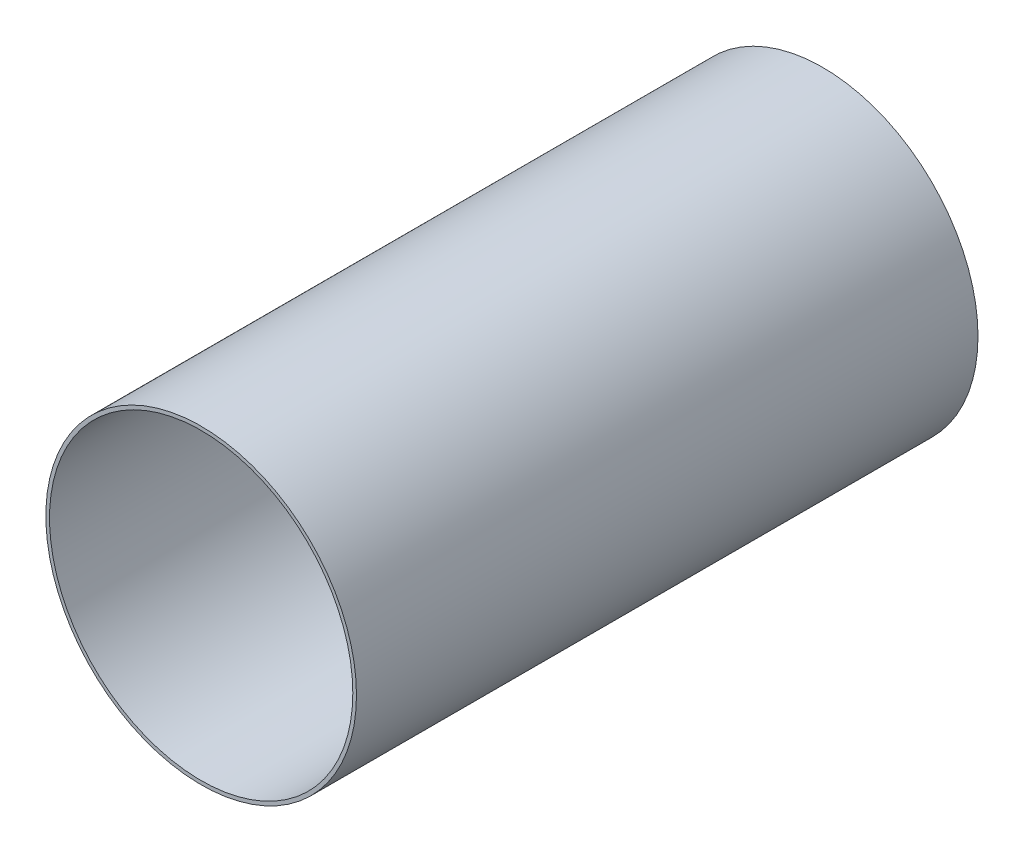
ISO-10303-21;
HEADER;
FILE_DESCRIPTION(('STEP AP214'),'2;1');
FILE_NAME('part.step','',(''),(''),'','','');
FILE_SCHEMA(('AUTOMOTIVE_DESIGN { 1 0 10303 214 1 1 1 1 }'));
ENDSEC;
DATA;
#1=APPLICATION_CONTEXT('core data for automotive mechanical design processes');
#2=APPLICATION_PROTOCOL_DEFINITION('international standard','automotive_design',2000,#1);
#3=PRODUCT_CONTEXT('',#1,'mechanical');
#4=PRODUCT('Part','Part','',(#3));
#5=PRODUCT_RELATED_PRODUCT_CATEGORY('part','',(#4));
#6=PRODUCT_DEFINITION_FORMATION('','',#4);
#7=PRODUCT_DEFINITION_CONTEXT('part definition',#1,'design');
#8=PRODUCT_DEFINITION('design','',#6,#7);
#9=PRODUCT_DEFINITION_SHAPE('','',#8);
#10=(LENGTH_UNIT() NAMED_UNIT(*) SI_UNIT(.MILLI.,.METRE.));
#11=(NAMED_UNIT(*) PLANE_ANGLE_UNIT() SI_UNIT($,.RADIAN.));
#12=(NAMED_UNIT(*) SI_UNIT($,.STERADIAN.) SOLID_ANGLE_UNIT());
#13=UNCERTAINTY_MEASURE_WITH_UNIT(LENGTH_MEASURE(1.E-05),#10,'distance_accuracy_value','');
#14=(GEOMETRIC_REPRESENTATION_CONTEXT(3) GLOBAL_UNCERTAINTY_ASSIGNED_CONTEXT((#13)) GLOBAL_UNIT_ASSIGNED_CONTEXT((#10,
#11,#12)) REPRESENTATION_CONTEXT('',''));
#15=CARTESIAN_POINT('',(0.,0.,0.));
#16=DIRECTION('',(0.,0.,1.));
#17=DIRECTION('',(1.,0.,0.));
#18=AXIS2_PLACEMENT_3D('',#15,#16,#17);
#19=CARTESIAN_POINT('',(0.,0.,127.));
#20=DIRECTION('',(0.,0.,1.));
#21=DIRECTION('',(1.,0.,0.));
#22=AXIS2_PLACEMENT_3D('',#19,#20,#21);
#23=PLANE('',#22);
#24=CARTESIAN_POINT('',(0.,0.,127.));
#25=DIRECTION('',(0.,0.,1.));
#26=DIRECTION('',(1.,0.,0.));
#27=AXIS2_PLACEMENT_3D('',#24,#25,#26);
#28=CIRCLE('',#27,63.4746);
#29=CARTESIAN_POINT('',(63.4746,0.,127.));
#30=VERTEX_POINT('',#29);
#31=EDGE_CURVE('E10',#30,#30,#28,.T.);
#32=ORIENTED_EDGE('',*,*,#31,.T.);
#33=EDGE_LOOP('',(#32));
#34=FACE_BOUND('',#33,.T.);
#35=CARTESIAN_POINT('',(0.,0.,127.));
#36=DIRECTION('',(0.,0.,1.));
#37=DIRECTION('',(1.,0.,0.));
#38=AXIS2_PLACEMENT_3D('',#35,#36,#37);
#39=CIRCLE('',#38,61.976);
#40=CARTESIAN_POINT('',(61.976,0.,127.));
#41=VERTEX_POINT('',#40);
#42=EDGE_CURVE('E59',#41,#41,#39,.T.);
#43=ORIENTED_EDGE('',*,*,#42,.F.);
#44=EDGE_LOOP('',(#43));
#45=FACE_BOUND('',#44,.T.);
#46=ADVANCED_FACE('F45',(#34,#45),#23,.T.);
#47=CARTESIAN_POINT('',(0.,0.,-127.));
#48=DIRECTION('',(0.,0.,1.));
#49=DIRECTION('',(1.,0.,0.));
#50=AXIS2_PLACEMENT_3D('',#47,#48,#49);
#51=PLANE('',#50);
#52=CARTESIAN_POINT('',(0.,0.,-127.));
#53=DIRECTION('',(0.,0.,1.));
#54=DIRECTION('',(1.,0.,0.));
#55=AXIS2_PLACEMENT_3D('',#52,#53,#54);
#56=CIRCLE('',#55,63.4746);
#57=CARTESIAN_POINT('',(63.4746,0.,-127.));
#58=VERTEX_POINT('',#57);
#59=EDGE_CURVE('E49',#58,#58,#56,.T.);
#60=ORIENTED_EDGE('',*,*,#59,.F.);
#61=EDGE_LOOP('',(#60));
#62=FACE_BOUND('',#61,.T.);
#63=CARTESIAN_POINT('',(0.,0.,-127.));
#64=DIRECTION('',(0.,0.,1.));
#65=DIRECTION('',(1.,0.,0.));
#66=AXIS2_PLACEMENT_3D('',#63,#64,#65);
#67=CIRCLE('',#66,61.976);
#68=CARTESIAN_POINT('',(61.976,0.,-127.));
#69=VERTEX_POINT('',#68);
#70=EDGE_CURVE('E61',#69,#69,#67,.T.);
#71=ORIENTED_EDGE('',*,*,#70,.T.);
#72=EDGE_LOOP('',(#71));
#73=FACE_BOUND('',#72,.T.);
#74=ADVANCED_FACE('F74',(#62,#73),#51,.F.);
#75=CARTESIAN_POINT('',(0.,0.,127.));
#76=DIRECTION('',(0.,0.,-1.));
#77=DIRECTION('',(-1.,0.,0.));
#78=AXIS2_PLACEMENT_3D('',#75,#76,#77);
#79=CYLINDRICAL_SURFACE('',#78,63.4746);
#80=ORIENTED_EDGE('',*,*,#31,.F.);
#81=EDGE_LOOP('',(#80));
#82=FACE_BOUND('',#81,.T.);
#83=ORIENTED_EDGE('',*,*,#59,.T.);
#84=EDGE_LOOP('',(#83));
#85=FACE_BOUND('',#84,.T.);
#86=ADVANCED_FACE('F47',(#82,#85),#79,.T.);
#87=CARTESIAN_POINT('',(0.,0.,127.));
#88=DIRECTION('',(0.,0.,-1.));
#89=DIRECTION('',(-1.,0.,0.));
#90=AXIS2_PLACEMENT_3D('',#87,#88,#89);
#91=CYLINDRICAL_SURFACE('',#90,61.976);
#92=ORIENTED_EDGE('',*,*,#42,.T.);
#93=EDGE_LOOP('',(#92));
#94=FACE_BOUND('',#93,.T.);
#95=ORIENTED_EDGE('',*,*,#70,.F.);
#96=EDGE_LOOP('',(#95));
#97=FACE_BOUND('',#96,.T.);
#98=ADVANCED_FACE('F70',(#94,#97),#91,.F.);
#99=CLOSED_SHELL('',(#46,#74,#86,#98));
#100=MANIFOLD_SOLID_BREP('B2',#99);
#101=ADVANCED_BREP_SHAPE_REPRESENTATION('',(#18,#100),#14);
#102=SHAPE_DEFINITION_REPRESENTATION(#9,#101);
ENDSEC;
END-ISO-10303-21;
